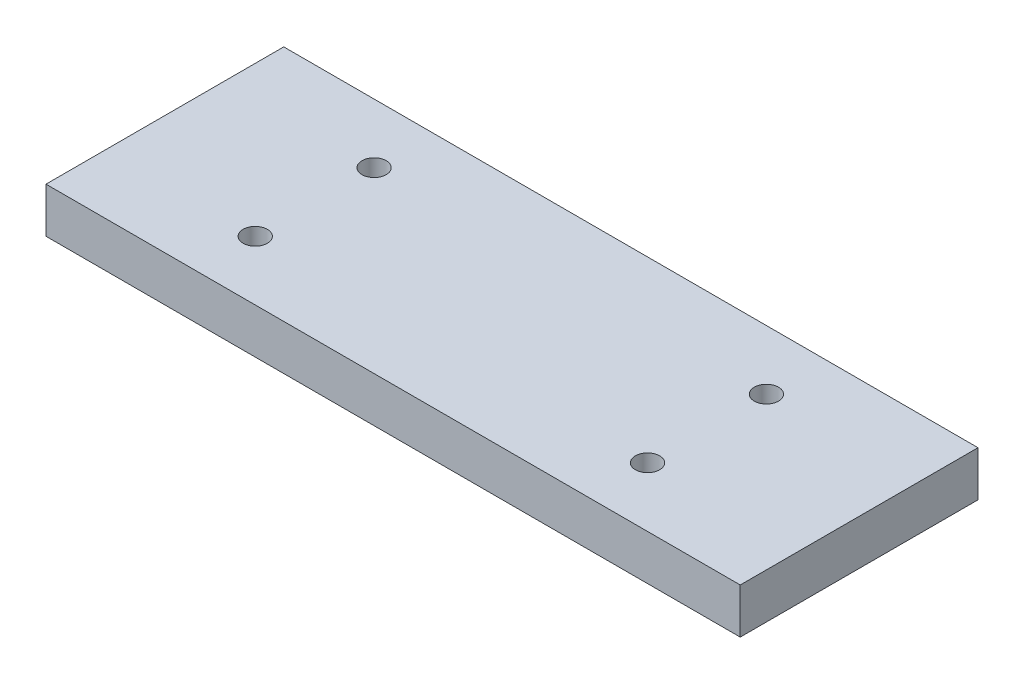
ISO-10303-21;
HEADER;
FILE_DESCRIPTION(('STEP AP214'),'2;1');
FILE_NAME('part.step','',(''),(''),'','','');
FILE_SCHEMA(('AUTOMOTIVE_DESIGN { 1 0 10303 214 1 1 1 1 }'));
ENDSEC;
DATA;
#1=APPLICATION_CONTEXT('core data for automotive mechanical design processes');
#2=APPLICATION_PROTOCOL_DEFINITION('international standard','automotive_design',2000,#1);
#3=PRODUCT_CONTEXT('',#1,'mechanical');
#4=PRODUCT('Part','Part','',(#3));
#5=PRODUCT_RELATED_PRODUCT_CATEGORY('part','',(#4));
#6=PRODUCT_DEFINITION_FORMATION('','',#4);
#7=PRODUCT_DEFINITION_CONTEXT('part definition',#1,'design');
#8=PRODUCT_DEFINITION('design','',#6,#7);
#9=PRODUCT_DEFINITION_SHAPE('','',#8);
#10=(LENGTH_UNIT() NAMED_UNIT(*) SI_UNIT(.MILLI.,.METRE.));
#11=(NAMED_UNIT(*) PLANE_ANGLE_UNIT() SI_UNIT($,.RADIAN.));
#12=(NAMED_UNIT(*) SI_UNIT($,.STERADIAN.) SOLID_ANGLE_UNIT());
#13=UNCERTAINTY_MEASURE_WITH_UNIT(LENGTH_MEASURE(1.E-05),#10,'distance_accuracy_value','');
#14=(GEOMETRIC_REPRESENTATION_CONTEXT(3) GLOBAL_UNCERTAINTY_ASSIGNED_CONTEXT((#13)) GLOBAL_UNIT_ASSIGNED_CONTEXT((#10,
#11,#12)) REPRESENTATION_CONTEXT('',''));
#15=CARTESIAN_POINT('',(0.,0.,0.));
#16=DIRECTION('',(0.,0.,1.));
#17=DIRECTION('',(1.,0.,0.));
#18=AXIS2_PLACEMENT_3D('',#15,#16,#17);
#19=CARTESIAN_POINT('',(146.,19.,-50.));
#20=DIRECTION('',(-1.,0.,0.));
#21=DIRECTION('',(0.,0.,1.));
#22=AXIS2_PLACEMENT_3D('',#19,#20,#21);
#23=PLANE('',#22);
#24=DIRECTION('',(0.,0.,-1.));
#25=VECTOR('',#24,1.);
#26=CARTESIAN_POINT('',(146.,0.,-50.));
#27=LINE('',#26,#25);
#28=CARTESIAN_POINT('',(146.,0.,50.));
#29=VERTEX_POINT('',#28);
#30=CARTESIAN_POINT('',(146.,0.,-50.));
#31=VERTEX_POINT('',#30);
#32=EDGE_CURVE('E115',#29,#31,#27,.T.);
#33=ORIENTED_EDGE('',*,*,#32,.T.);
#34=DIRECTION('',(0.,-1.,0.));
#35=VECTOR('',#34,1.);
#36=CARTESIAN_POINT('',(146.,19.,-50.));
#37=LINE('',#36,#35);
#38=CARTESIAN_POINT('',(146.,19.,-50.));
#39=VERTEX_POINT('',#38);
#40=EDGE_CURVE('E11',#39,#31,#37,.T.);
#41=ORIENTED_EDGE('',*,*,#40,.F.);
#42=DIRECTION('',(0.,0.,-1.));
#43=VECTOR('',#42,1.);
#44=CARTESIAN_POINT('',(146.,19.,-50.));
#45=LINE('',#44,#43);
#46=CARTESIAN_POINT('',(146.,19.,50.));
#47=VERTEX_POINT('',#46);
#48=EDGE_CURVE('E99',#47,#39,#45,.T.);
#49=ORIENTED_EDGE('',*,*,#48,.F.);
#50=DIRECTION('',(0.,-1.,0.));
#51=VECTOR('',#50,1.);
#52=CARTESIAN_POINT('',(146.,19.,50.));
#53=LINE('',#52,#51);
#54=EDGE_CURVE('E111',#47,#29,#53,.T.);
#55=ORIENTED_EDGE('',*,*,#54,.T.);
#56=EDGE_LOOP('',(#33,#41,#49,#55));
#57=FACE_BOUND('',#56,.T.);
#58=ADVANCED_FACE('F47',(#57),#23,.F.);
#59=CARTESIAN_POINT('',(-146.,19.,-50.));
#60=DIRECTION('',(0.,0.,1.));
#61=DIRECTION('',(1.,0.,0.));
#62=AXIS2_PLACEMENT_3D('',#59,#60,#61);
#63=PLANE('',#62);
#64=DIRECTION('',(-1.,0.,0.));
#65=VECTOR('',#64,1.);
#66=CARTESIAN_POINT('',(-146.,0.,-50.));
#67=LINE('',#66,#65);
#68=CARTESIAN_POINT('',(-146.,0.,-50.));
#69=VERTEX_POINT('',#68);
#70=EDGE_CURVE('E104',#31,#69,#67,.T.);
#71=ORIENTED_EDGE('',*,*,#70,.T.);
#72=DIRECTION('',(0.,-1.,0.));
#73=VECTOR('',#72,1.);
#74=CARTESIAN_POINT('',(-146.,19.,-50.));
#75=LINE('',#74,#73);
#76=CARTESIAN_POINT('',(-146.,19.,-50.));
#77=VERTEX_POINT('',#76);
#78=EDGE_CURVE('E56',#77,#69,#75,.T.);
#79=ORIENTED_EDGE('',*,*,#78,.F.);
#80=DIRECTION('',(-1.,0.,0.));
#81=VECTOR('',#80,1.);
#82=CARTESIAN_POINT('',(-146.,19.,-50.));
#83=LINE('',#82,#81);
#84=EDGE_CURVE('E94',#39,#77,#83,.T.);
#85=ORIENTED_EDGE('',*,*,#84,.F.);
#86=ORIENTED_EDGE('',*,*,#40,.T.);
#87=EDGE_LOOP('',(#71,#79,#85,#86));
#88=FACE_BOUND('',#87,.T.);
#89=ADVANCED_FACE('F103',(#88),#63,.F.);
#90=CARTESIAN_POINT('',(-146.,19.,-50.));
#91=DIRECTION('',(1.,0.,0.));
#92=DIRECTION('',(0.,0.,-1.));
#93=AXIS2_PLACEMENT_3D('',#90,#91,#92);
#94=PLANE('',#93);
#95=DIRECTION('',(0.,0.,1.));
#96=VECTOR('',#95,1.);
#97=CARTESIAN_POINT('',(-146.,0.,-50.));
#98=LINE('',#97,#96);
#99=CARTESIAN_POINT('',(-146.,0.,50.));
#100=VERTEX_POINT('',#99);
#101=EDGE_CURVE('E81',#69,#100,#98,.T.);
#102=ORIENTED_EDGE('',*,*,#101,.T.);
#103=DIRECTION('',(0.,-1.,0.));
#104=VECTOR('',#103,1.);
#105=CARTESIAN_POINT('',(-146.,19.,50.));
#106=LINE('',#105,#104);
#107=CARTESIAN_POINT('',(-146.,19.,50.));
#108=VERTEX_POINT('',#107);
#109=EDGE_CURVE('E106',#108,#100,#106,.T.);
#110=ORIENTED_EDGE('',*,*,#109,.F.);
#111=DIRECTION('',(0.,0.,1.));
#112=VECTOR('',#111,1.);
#113=CARTESIAN_POINT('',(-146.,19.,-50.));
#114=LINE('',#113,#112);
#115=EDGE_CURVE('E97',#77,#108,#114,.T.);
#116=ORIENTED_EDGE('',*,*,#115,.F.);
#117=ORIENTED_EDGE('',*,*,#78,.T.);
#118=EDGE_LOOP('',(#102,#110,#116,#117));
#119=FACE_BOUND('',#118,.T.);
#120=ADVANCED_FACE('F107',(#119),#94,.F.);
#121=CARTESIAN_POINT('',(-146.,19.,50.));
#122=DIRECTION('',(0.,0.,-1.));
#123=DIRECTION('',(-1.,0.,0.));
#124=AXIS2_PLACEMENT_3D('',#121,#122,#123);
#125=PLANE('',#124);
#126=DIRECTION('',(1.,0.,0.));
#127=VECTOR('',#126,1.);
#128=CARTESIAN_POINT('',(-146.,0.,50.));
#129=LINE('',#128,#127);
#130=EDGE_CURVE('E87',#100,#29,#129,.T.);
#131=ORIENTED_EDGE('',*,*,#130,.T.);
#132=ORIENTED_EDGE('',*,*,#54,.F.);
#133=DIRECTION('',(1.,0.,0.));
#134=VECTOR('',#133,1.);
#135=CARTESIAN_POINT('',(-146.,19.,50.));
#136=LINE('',#135,#134);
#137=EDGE_CURVE('E64',#108,#47,#136,.T.);
#138=ORIENTED_EDGE('',*,*,#137,.F.);
#139=ORIENTED_EDGE('',*,*,#109,.T.);
#140=EDGE_LOOP('',(#131,#132,#138,#139));
#141=FACE_BOUND('',#140,.T.);
#142=ADVANCED_FACE('F129',(#141),#125,.F.);
#143=CARTESIAN_POINT('',(0.,19.,0.));
#144=DIRECTION('',(0.,1.,0.));
#145=DIRECTION('',(0.,0.,1.));
#146=AXIS2_PLACEMENT_3D('',#143,#144,#145);
#147=PLANE('',#146);
#148=CARTESIAN_POINT('',(-83.,19.,-25.));
#149=DIRECTION('',(0.,1.,0.));
#150=DIRECTION('',(0.,0.,1.));
#151=AXIS2_PLACEMENT_3D('',#148,#149,#150);
#152=CIRCLE('',#151,5.09999999999999);
#153=CARTESIAN_POINT('',(-83.,19.,-19.9));
#154=VERTEX_POINT('',#153);
#155=EDGE_CURVE('E163',#154,#154,#152,.T.);
#156=ORIENTED_EDGE('',*,*,#155,.F.);
#157=EDGE_LOOP('',(#156));
#158=FACE_BOUND('',#157,.T.);
#159=CARTESIAN_POINT('',(82.,19.,-25.));
#160=DIRECTION('',(0.,1.,0.));
#161=DIRECTION('',(0.,0.,1.));
#162=AXIS2_PLACEMENT_3D('',#159,#160,#161);
#163=CIRCLE('',#162,5.09999999999999);
#164=CARTESIAN_POINT('',(82.,19.,-19.9));
#165=VERTEX_POINT('',#164);
#166=EDGE_CURVE('E155',#165,#165,#163,.T.);
#167=ORIENTED_EDGE('',*,*,#166,.F.);
#168=EDGE_LOOP('',(#167));
#169=FACE_BOUND('',#168,.T.);
#170=CARTESIAN_POINT('',(82.,19.,25.));
#171=DIRECTION('',(0.,1.,0.));
#172=DIRECTION('',(0.,0.,1.));
#173=AXIS2_PLACEMENT_3D('',#170,#171,#172);
#174=CIRCLE('',#173,5.09999999999999);
#175=CARTESIAN_POINT('',(82.,19.,30.1));
#176=VERTEX_POINT('',#175);
#177=EDGE_CURVE('E147',#176,#176,#174,.T.);
#178=ORIENTED_EDGE('',*,*,#177,.F.);
#179=EDGE_LOOP('',(#178));
#180=FACE_BOUND('',#179,.T.);
#181=CARTESIAN_POINT('',(-83.,19.,25.));
#182=DIRECTION('',(0.,1.,0.));
#183=DIRECTION('',(0.,0.,1.));
#184=AXIS2_PLACEMENT_3D('',#181,#182,#183);
#185=CIRCLE('',#184,5.09999999999999);
#186=CARTESIAN_POINT('',(-83.,19.,30.1));
#187=VERTEX_POINT('',#186);
#188=EDGE_CURVE('E139',#187,#187,#185,.T.);
#189=ORIENTED_EDGE('',*,*,#188,.F.);
#190=EDGE_LOOP('',(#189));
#191=FACE_BOUND('',#190,.T.);
#192=ORIENTED_EDGE('',*,*,#48,.T.);
#193=ORIENTED_EDGE('',*,*,#84,.T.);
#194=ORIENTED_EDGE('',*,*,#115,.T.);
#195=ORIENTED_EDGE('',*,*,#137,.T.);
#196=EDGE_LOOP('',(#192,#193,#194,#195));
#197=FACE_BOUND('',#196,.T.);
#198=ADVANCED_FACE('F95',(#158,#169,#180,#191,#197),#147,.T.);
#199=CARTESIAN_POINT('',(0.,0.,0.));
#200=DIRECTION('',(0.,1.,0.));
#201=DIRECTION('',(0.,0.,1.));
#202=AXIS2_PLACEMENT_3D('',#199,#200,#201);
#203=PLANE('',#202);
#204=CARTESIAN_POINT('',(-83.,0.,-25.));
#205=DIRECTION('',(0.,1.,0.));
#206=DIRECTION('',(0.,0.,1.));
#207=AXIS2_PLACEMENT_3D('',#204,#205,#206);
#208=CIRCLE('',#207,5.09999999999999);
#209=CARTESIAN_POINT('',(-83.,0.,-19.9));
#210=VERTEX_POINT('',#209);
#211=EDGE_CURVE('E159',#210,#210,#208,.T.);
#212=ORIENTED_EDGE('',*,*,#211,.T.);
#213=EDGE_LOOP('',(#212));
#214=FACE_BOUND('',#213,.T.);
#215=CARTESIAN_POINT('',(82.,0.,-25.));
#216=DIRECTION('',(0.,1.,0.));
#217=DIRECTION('',(0.,0.,1.));
#218=AXIS2_PLACEMENT_3D('',#215,#216,#217);
#219=CIRCLE('',#218,5.09999999999999);
#220=CARTESIAN_POINT('',(82.,0.,-19.9));
#221=VERTEX_POINT('',#220);
#222=EDGE_CURVE('E151',#221,#221,#219,.T.);
#223=ORIENTED_EDGE('',*,*,#222,.T.);
#224=EDGE_LOOP('',(#223));
#225=FACE_BOUND('',#224,.T.);
#226=CARTESIAN_POINT('',(82.,0.,25.));
#227=DIRECTION('',(0.,1.,0.));
#228=DIRECTION('',(0.,0.,1.));
#229=AXIS2_PLACEMENT_3D('',#226,#227,#228);
#230=CIRCLE('',#229,5.09999999999999);
#231=CARTESIAN_POINT('',(82.,0.,30.1));
#232=VERTEX_POINT('',#231);
#233=EDGE_CURVE('E143',#232,#232,#230,.T.);
#234=ORIENTED_EDGE('',*,*,#233,.T.);
#235=EDGE_LOOP('',(#234));
#236=FACE_BOUND('',#235,.T.);
#237=CARTESIAN_POINT('',(-83.,0.,25.));
#238=DIRECTION('',(0.,1.,0.));
#239=DIRECTION('',(0.,0.,1.));
#240=AXIS2_PLACEMENT_3D('',#237,#238,#239);
#241=CIRCLE('',#240,5.09999999999999);
#242=CARTESIAN_POINT('',(-83.,0.,30.1));
#243=VERTEX_POINT('',#242);
#244=EDGE_CURVE('E119',#243,#243,#241,.T.);
#245=ORIENTED_EDGE('',*,*,#244,.T.);
#246=EDGE_LOOP('',(#245));
#247=FACE_BOUND('',#246,.T.);
#248=ORIENTED_EDGE('',*,*,#32,.F.);
#249=ORIENTED_EDGE('',*,*,#130,.F.);
#250=ORIENTED_EDGE('',*,*,#101,.F.);
#251=ORIENTED_EDGE('',*,*,#70,.F.);
#252=EDGE_LOOP('',(#248,#249,#250,#251));
#253=FACE_BOUND('',#252,.T.);
#254=ADVANCED_FACE('F132',(#214,#225,#236,#247,#253),#203,.F.);
#255=CARTESIAN_POINT('',(-83.,19.,25.));
#256=DIRECTION('',(0.,1.,0.));
#257=DIRECTION('',(0.,0.,1.));
#258=AXIS2_PLACEMENT_3D('',#255,#256,#257);
#259=CYLINDRICAL_SURFACE('',#258,5.09999999999999);
#260=ORIENTED_EDGE('',*,*,#244,.F.);
#261=EDGE_LOOP('',(#260));
#262=FACE_BOUND('',#261,.T.);
#263=ORIENTED_EDGE('',*,*,#188,.T.);
#264=EDGE_LOOP('',(#263));
#265=FACE_BOUND('',#264,.T.);
#266=ADVANCED_FACE('F179',(#262,#265),#259,.F.);
#267=CARTESIAN_POINT('',(82.,19.,25.));
#268=DIRECTION('',(0.,1.,0.));
#269=DIRECTION('',(0.,0.,1.));
#270=AXIS2_PLACEMENT_3D('',#267,#268,#269);
#271=CYLINDRICAL_SURFACE('',#270,5.09999999999999);
#272=ORIENTED_EDGE('',*,*,#233,.F.);
#273=EDGE_LOOP('',(#272));
#274=FACE_BOUND('',#273,.T.);
#275=ORIENTED_EDGE('',*,*,#177,.T.);
#276=EDGE_LOOP('',(#275));
#277=FACE_BOUND('',#276,.T.);
#278=ADVANCED_FACE('F181',(#274,#277),#271,.F.);
#279=CARTESIAN_POINT('',(82.,19.,-25.));
#280=DIRECTION('',(0.,1.,0.));
#281=DIRECTION('',(0.,0.,1.));
#282=AXIS2_PLACEMENT_3D('',#279,#280,#281);
#283=CYLINDRICAL_SURFACE('',#282,5.09999999999999);
#284=ORIENTED_EDGE('',*,*,#222,.F.);
#285=EDGE_LOOP('',(#284));
#286=FACE_BOUND('',#285,.T.);
#287=ORIENTED_EDGE('',*,*,#166,.T.);
#288=EDGE_LOOP('',(#287));
#289=FACE_BOUND('',#288,.T.);
#290=ADVANCED_FACE('F188',(#286,#289),#283,.F.);
#291=CARTESIAN_POINT('',(-83.,19.,-25.));
#292=DIRECTION('',(0.,1.,0.));
#293=DIRECTION('',(0.,0.,1.));
#294=AXIS2_PLACEMENT_3D('',#291,#292,#293);
#295=CYLINDRICAL_SURFACE('',#294,5.09999999999999);
#296=ORIENTED_EDGE('',*,*,#211,.F.);
#297=EDGE_LOOP('',(#296));
#298=FACE_BOUND('',#297,.T.);
#299=ORIENTED_EDGE('',*,*,#155,.T.);
#300=EDGE_LOOP('',(#299));
#301=FACE_BOUND('',#300,.T.);
#302=ADVANCED_FACE('F168',(#298,#301),#295,.F.);
#303=CLOSED_SHELL('',(#58,#89,#120,#142,#198,#254,#266,#278,#290,#302));
#304=MANIFOLD_SOLID_BREP('B2',#303);
#305=ADVANCED_BREP_SHAPE_REPRESENTATION('',(#18,#304),#14);
#306=SHAPE_DEFINITION_REPRESENTATION(#9,#305);
ENDSEC;
END-ISO-10303-21;
